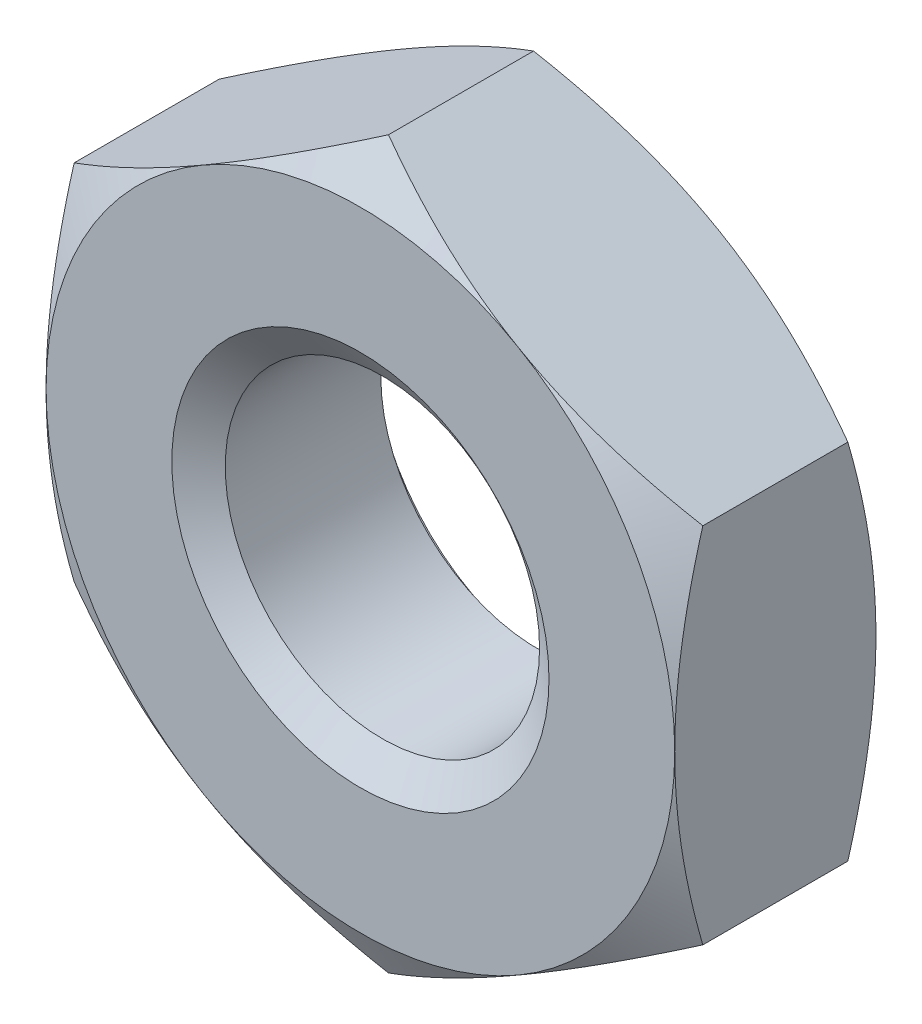
ISO-10303-21;
HEADER;
FILE_DESCRIPTION(('STEP AP214'),'2;1');
FILE_NAME('part.step','',(''),(''),'','','');
FILE_SCHEMA(('AUTOMOTIVE_DESIGN { 1 0 10303 214 1 1 1 1 }'));
ENDSEC;
DATA;
#1=APPLICATION_CONTEXT('core data for automotive mechanical design processes');
#2=APPLICATION_PROTOCOL_DEFINITION('international standard','automotive_design',2000,#1);
#3=PRODUCT_CONTEXT('',#1,'mechanical');
#4=PRODUCT('Part','Part','',(#3));
#5=PRODUCT_RELATED_PRODUCT_CATEGORY('part','',(#4));
#6=PRODUCT_DEFINITION_FORMATION('','',#4);
#7=PRODUCT_DEFINITION_CONTEXT('part definition',#1,'design');
#8=PRODUCT_DEFINITION('design','',#6,#7);
#9=PRODUCT_DEFINITION_SHAPE('','',#8);
#10=(LENGTH_UNIT() NAMED_UNIT(*) SI_UNIT(.MILLI.,.METRE.));
#11=(NAMED_UNIT(*) PLANE_ANGLE_UNIT() SI_UNIT($,.RADIAN.));
#12=(NAMED_UNIT(*) SI_UNIT($,.STERADIAN.) SOLID_ANGLE_UNIT());
#13=UNCERTAINTY_MEASURE_WITH_UNIT(LENGTH_MEASURE(1.E-05),#10,'distance_accuracy_value','');
#14=(GEOMETRIC_REPRESENTATION_CONTEXT(3) GLOBAL_UNCERTAINTY_ASSIGNED_CONTEXT((#13)) GLOBAL_UNIT_ASSIGNED_CONTEXT((#10,
#11,#12)) REPRESENTATION_CONTEXT('',''));
#15=CARTESIAN_POINT('',(0.,0.,0.));
#16=DIRECTION('',(0.,0.,1.));
#17=DIRECTION('',(1.,0.,0.));
#18=AXIS2_PLACEMENT_3D('',#15,#16,#17);
#19=CARTESIAN_POINT('',(0.,0.,-3.2));
#20=DIRECTION('',(0.,0.,1.));
#21=DIRECTION('',(1.,0.,0.));
#22=AXIS2_PLACEMENT_3D('',#19,#20,#21);
#23=CYLINDRICAL_SURFACE('',#22,2.5);
#24=CARTESIAN_POINT('',(0.,0.,-0.350103769104854));
#25=DIRECTION('',(0.,0.,1.));
#26=DIRECTION('',(1.,0.,0.));
#27=AXIS2_PLACEMENT_3D('',#24,#25,#26);
#28=CIRCLE('',#27,2.5);
#29=CARTESIAN_POINT('',(2.5,0.,-0.350103769104854));
#30=VERTEX_POINT('',#29);
#31=EDGE_CURVE('E176',#30,#30,#28,.F.);
#32=ORIENTED_EDGE('',*,*,#31,.F.);
#33=EDGE_LOOP('',(#32));
#34=FACE_BOUND('',#33,.T.);
#35=CARTESIAN_POINT('',(0.,0.,-2.82449623089514));
#36=DIRECTION('',(0.,0.,-1.));
#37=DIRECTION('',(-1.,0.,0.));
#38=AXIS2_PLACEMENT_3D('',#35,#36,#37);
#39=CIRCLE('',#38,2.5);
#40=CARTESIAN_POINT('',(-2.5,0.,-2.82449623089514));
#41=VERTEX_POINT('',#40);
#42=EDGE_CURVE('E40',#41,#41,#39,.F.);
#43=ORIENTED_EDGE('',*,*,#42,.F.);
#44=EDGE_LOOP('',(#43));
#45=FACE_BOUND('',#44,.T.);
#46=ADVANCED_FACE('F35',(#34,#45),#23,.F.);
#47=CARTESIAN_POINT('',(0.,5.77350269189626,-3.2));
#48=DIRECTION('',(-0.5,0.866025403784439,0.));
#49=DIRECTION('',(-0.866025403784439,-0.500000000000001,0.));
#50=AXIS2_PLACEMENT_3D('',#47,#48,#49);
#51=PLANE('',#50);
#52=DIRECTION('',(0.,0.,1.));
#53=VECTOR('',#52,1.);
#54=CARTESIAN_POINT('',(-5.,2.88675134594813,-3.2));
#55=LINE('',#54,#53);
#56=CARTESIAN_POINT('',(-5.,2.88675134594813,-2.7534180126148));
#57=VERTEX_POINT('',#56);
#58=CARTESIAN_POINT('',(-5.,2.88675134594813,-0.446581987385206));
#59=VERTEX_POINT('',#58);
#60=EDGE_CURVE('E166',#57,#59,#55,.T.);
#61=ORIENTED_EDGE('',*,*,#60,.T.);
#62=CARTESIAN_POINT('',(-5.0002,2.88663587589429,-0.446648656051832));
#63=CARTESIAN_POINT('',(-4.78046540547482,3.01349970319368,-0.373386567637638));
#64=CARTESIAN_POINT('',(-4.55885141554042,3.14144859993849,-0.306751321918095));
#65=CARTESIAN_POINT('',(-4.11178600454649,3.39956193532121,-0.190438991010813));
#66=CARTESIAN_POINT('',(-3.88632664040923,3.52973095989718,-0.14080304991579));
#67=CARTESIAN_POINT('',(-3.43816769477649,3.78847564779798,-0.0635510254186988));
#68=CARTESIAN_POINT('',(-3.21553790689581,3.91701101576052,-0.0354203782834903));
#69=CARTESIAN_POINT('',(-2.88081009815336,4.11026620624323,-0.0101949219536854));
#70=CARTESIAN_POINT('',(-2.76915780319494,4.17472868879311,-0.00461345976948479));
#71=CARTESIAN_POINT('',(-2.5457500293262,4.30371322717528,0.000797783248529184));
#72=CARTESIAN_POINT('',(-2.43399455370968,4.36823528110589,0.000627741741796185));
#73=CARTESIAN_POINT('',(-2.12781576914936,4.54500768479194,-0.00775363179203716));
#74=CARTESIAN_POINT('',(-1.93349391403278,4.65719946015293,-0.021829771897253));
#75=CARTESIAN_POINT('',(-1.54613989800229,4.88083840557982,-0.0664652571094332));
#76=CARTESIAN_POINT('',(-1.35310909862843,4.99228478956021,-0.0970398601475105));
#77=CARTESIAN_POINT('',(-0.964974657525144,5.21637431361295,-0.173468493621167));
#78=CARTESIAN_POINT('',(-0.769920001358263,5.32898917185759,-0.219646378878684));
#79=CARTESIAN_POINT('',(-0.382719654641231,5.55253939626498,-0.324451794491939));
#80=CARTESIAN_POINT('',(-0.190569004591913,5.66347762579592,-0.383054703437378));
#81=CARTESIAN_POINT('',(0.000200000000001414,5.7736181619501,-0.446648656051832));
#82=B_SPLINE_CURVE_WITH_KNOTS('',3,(#62,#63,#64,#65,#66,#67,#68,#69,#70,#71,#72,#73,#74,#75,#76,
#77,#78,#79,#80,#81),.UNSPECIFIED.,.F.,.F.,(4,2,2,2,2,2,2,2,2,4),(0.,0.792555841363091,
1.58701660053334,2.36181537487281,2.74884076077326,3.13585419177295,3.8096236259968,
4.48401723901189,5.17336882348929,5.86136694793725),.UNSPECIFIED.);
#83=CARTESIAN_POINT('',(-2.5,4.33012701892219,0.));
#84=VERTEX_POINT('',#83);
#85=EDGE_CURVE('E62',#59,#84,#82,.T.);
#86=ORIENTED_EDGE('',*,*,#85,.T.);
#87=CARTESIAN_POINT('',(0.,5.77350269189626,-0.446581987385206));
#88=VERTEX_POINT('',#87);
#89=EDGE_CURVE('E240',#84,#88,#82,.T.);
#90=ORIENTED_EDGE('',*,*,#89,.T.);
#91=DIRECTION('',(0.,0.,1.));
#92=VECTOR('',#91,1.);
#93=CARTESIAN_POINT('',(0.,5.77350269189626,-3.2));
#94=LINE('',#93,#92);
#95=CARTESIAN_POINT('',(0.,5.77350269189626,-2.7534180126148));
#96=VERTEX_POINT('',#95);
#97=EDGE_CURVE('E151',#96,#88,#94,.T.);
#98=ORIENTED_EDGE('',*,*,#97,.F.);
#99=CARTESIAN_POINT('',(-5.0002,2.88663587589429,-2.75335134394817));
#100=CARTESIAN_POINT('',(-4.78046540547482,3.01349970319368,-2.82661343236236));
#101=CARTESIAN_POINT('',(-4.55885141554042,3.14144859993849,-2.89324867808191));
#102=CARTESIAN_POINT('',(-4.11178600454649,3.39956193532121,-3.00956100898919));
#103=CARTESIAN_POINT('',(-3.88632664040923,3.52973095989718,-3.05919695008421));
#104=CARTESIAN_POINT('',(-3.43816769477649,3.78847564779798,-3.1364489745813));
#105=CARTESIAN_POINT('',(-3.21553790689581,3.91701101576052,-3.16457962171651));
#106=CARTESIAN_POINT('',(-2.88081009815336,4.11026620624323,-3.18980507804632));
#107=CARTESIAN_POINT('',(-2.76915780319494,4.17472868879311,-3.19538654023052));
#108=CARTESIAN_POINT('',(-2.5457500293262,4.30371322717528,-3.20079778324853));
#109=CARTESIAN_POINT('',(-2.43399455370968,4.36823528110589,-3.2006277417418));
#110=CARTESIAN_POINT('',(-2.12781576914936,4.54500768479194,-3.19224636820796));
#111=CARTESIAN_POINT('',(-1.93349391403278,4.65719946015293,-3.17817022810275));
#112=CARTESIAN_POINT('',(-1.54613989800229,4.88083840557982,-3.13353474289057));
#113=CARTESIAN_POINT('',(-1.35310909862843,4.99228478956021,-3.10296013985249));
#114=CARTESIAN_POINT('',(-0.964974657525144,5.21637431361295,-3.02653150637883));
#115=CARTESIAN_POINT('',(-0.769920001358262,5.32898917185759,-2.98035362112132));
#116=CARTESIAN_POINT('',(-0.38271965464123,5.55253939626498,-2.87554820550806));
#117=CARTESIAN_POINT('',(-0.190569004591912,5.66347762579592,-2.81694529656262));
#118=CARTESIAN_POINT('',(0.000200000000001414,5.7736181619501,-2.75335134394817));
#119=B_SPLINE_CURVE_WITH_KNOTS('',3,(#99,#100,#101,#102,#103,#104,#105,#106,#107,#108,#109,#110,
#111,#112,#113,#114,#115,#116,#117,#118),.UNSPECIFIED.,.F.,.F.,(4,2,2,2,2,2,2,2,2,4),(0.,
0.792555841363092,1.58701660053334,2.36181537487281,2.74884076077326,3.13585419177295,
3.8096236259968,4.4840172390119,5.17336882348929,5.86136694793726),.UNSPECIFIED.);
#120=CARTESIAN_POINT('',(-2.5,4.33012701892219,-3.2));
#121=VERTEX_POINT('',#120);
#122=EDGE_CURVE('E169',#121,#96,#119,.T.);
#123=ORIENTED_EDGE('',*,*,#122,.F.);
#124=EDGE_CURVE('E261',#57,#121,#119,.T.);
#125=ORIENTED_EDGE('',*,*,#124,.F.);
#126=EDGE_LOOP('',(#61,#86,#90,#98,#123,#125));
#127=FACE_BOUND('',#126,.T.);
#128=ADVANCED_FACE('F37',(#127),#51,.T.);
#129=CARTESIAN_POINT('',(5.,2.88675134594813,-3.2));
#130=DIRECTION('',(0.500000000000001,0.866025403784439,0.));
#131=DIRECTION('',(-0.866025403784439,0.500000000000001,0.));
#132=AXIS2_PLACEMENT_3D('',#129,#130,#131);
#133=PLANE('',#132);
#134=ORIENTED_EDGE('',*,*,#97,.T.);
#135=CARTESIAN_POINT('',(-0.000199999999997945,5.7736181619501,-0.446648656051832));
#136=CARTESIAN_POINT('',(0.219534594525187,5.64675433465071,-0.373386567637638));
#137=CARTESIAN_POINT('',(0.441148584459583,5.5188054379059,-0.306751321918095));
#138=CARTESIAN_POINT('',(0.888213995453516,5.26069210252318,-0.190438991010813));
#139=CARTESIAN_POINT('',(1.11367335959078,5.13052307794721,-0.14080304991579));
#140=CARTESIAN_POINT('',(1.56183230522351,4.87177839004641,-0.0635510254186984));
#141=CARTESIAN_POINT('',(1.7844620931042,4.74324302208387,-0.0354203782834898));
#142=CARTESIAN_POINT('',(2.11918990184665,4.54998783160116,-0.0101949219536851));
#143=CARTESIAN_POINT('',(2.23084219680507,4.48552534905128,-0.00461345976948458));
#144=CARTESIAN_POINT('',(2.4542499706738,4.35654081066911,0.000797783248529218));
#145=CARTESIAN_POINT('',(2.56600544629032,4.2920187567385,0.000627741741796173));
#146=CARTESIAN_POINT('',(2.87218423085064,4.11524635305244,-0.00775363179203714));
#147=CARTESIAN_POINT('',(3.06650608596722,4.00305457769146,-0.0218297718972527));
#148=CARTESIAN_POINT('',(3.45386010199771,3.77941563226457,-0.0664652571094328));
#149=CARTESIAN_POINT('',(3.64689090137157,3.66796924828418,-0.0970398601475101));
#150=CARTESIAN_POINT('',(4.03502534247486,3.44387972423144,-0.173468493621166));
#151=CARTESIAN_POINT('',(4.23007999864174,3.3312648659868,-0.219646378878683));
#152=CARTESIAN_POINT('',(4.61728034535877,3.1077146415794,-0.324451794491937));
#153=CARTESIAN_POINT('',(4.80943099540809,2.99677641204847,-0.383054703437377));
#154=CARTESIAN_POINT('',(5.0002,2.88663587589429,-0.446648656051832));
#155=B_SPLINE_CURVE_WITH_KNOTS('',3,(#135,#136,#137,#138,#139,#140,#141,#142,#143,#144,#145,
#146,#147,#148,#149,#150,#151,#152,#153,#154),.UNSPECIFIED.,.F.,.F.,(4,2,2,2,2,2,2,2,2,4),(0.,
0.792555841363091,1.58701660053334,2.36181537487281,2.74884076077326,3.13585419177295,
3.8096236259968,4.4840172390119,5.17336882348929,5.86136694793725),.UNSPECIFIED.);
#156=CARTESIAN_POINT('',(2.5,4.33012701892219,0.));
#157=VERTEX_POINT('',#156);
#158=EDGE_CURVE('E144',#88,#157,#155,.T.);
#159=ORIENTED_EDGE('',*,*,#158,.T.);
#160=CARTESIAN_POINT('',(5.,2.88675134594813,-0.446581987385206));
#161=VERTEX_POINT('',#160);
#162=EDGE_CURVE('E130',#157,#161,#155,.T.);
#163=ORIENTED_EDGE('',*,*,#162,.T.);
#164=DIRECTION('',(0.,0.,1.));
#165=VECTOR('',#164,1.);
#166=CARTESIAN_POINT('',(5.,2.88675134594813,-3.2));
#167=LINE('',#166,#165);
#168=CARTESIAN_POINT('',(5.,2.88675134594813,-2.7534180126148));
#169=VERTEX_POINT('',#168);
#170=EDGE_CURVE('E143',#169,#161,#167,.T.);
#171=ORIENTED_EDGE('',*,*,#170,.F.);
#172=CARTESIAN_POINT('',(-0.000199999999997945,5.7736181619501,-2.75335134394817));
#173=CARTESIAN_POINT('',(0.219534594525188,5.64675433465071,-2.82661343236236));
#174=CARTESIAN_POINT('',(0.441148584459583,5.5188054379059,-2.89324867808191));
#175=CARTESIAN_POINT('',(0.888213995453516,5.26069210252318,-3.00956100898919));
#176=CARTESIAN_POINT('',(1.11367335959078,5.13052307794721,-3.05919695008421));
#177=CARTESIAN_POINT('',(1.56183230522351,4.87177839004641,-3.1364489745813));
#178=CARTESIAN_POINT('',(1.7844620931042,4.74324302208387,-3.16457962171651));
#179=CARTESIAN_POINT('',(2.11918990184665,4.54998783160116,-3.18980507804632));
#180=CARTESIAN_POINT('',(2.23084219680507,4.48552534905128,-3.19538654023052));
#181=CARTESIAN_POINT('',(2.4542499706738,4.35654081066911,-3.20079778324853));
#182=CARTESIAN_POINT('',(2.56600544629032,4.2920187567385,-3.2006277417418));
#183=CARTESIAN_POINT('',(2.87218423085064,4.11524635305244,-3.19224636820796));
#184=CARTESIAN_POINT('',(3.06650608596722,4.00305457769146,-3.17817022810275));
#185=CARTESIAN_POINT('',(3.45386010199771,3.77941563226457,-3.13353474289057));
#186=CARTESIAN_POINT('',(3.64689090137157,3.66796924828418,-3.10296013985249));
#187=CARTESIAN_POINT('',(4.03502534247486,3.44387972423144,-3.02653150637884));
#188=CARTESIAN_POINT('',(4.23007999864174,3.3312648659868,-2.98035362112132));
#189=CARTESIAN_POINT('',(4.61728034535877,3.1077146415794,-2.87554820550806));
#190=CARTESIAN_POINT('',(4.80943099540809,2.99677641204847,-2.81694529656262));
#191=CARTESIAN_POINT('',(5.0002,2.88663587589429,-2.75335134394817));
#192=B_SPLINE_CURVE_WITH_KNOTS('',3,(#172,#173,#174,#175,#176,#177,#178,#179,#180,#181,#182,
#183,#184,#185,#186,#187,#188,#189,#190,#191),.UNSPECIFIED.,.F.,.F.,(4,2,2,2,2,2,2,2,2,4),(0.,
0.792555841363092,1.58701660053334,2.36181537487281,2.74884076077326,3.13585419177295,
3.8096236259968,4.48401723901189,5.17336882348929,5.86136694793725),.UNSPECIFIED.);
#193=CARTESIAN_POINT('',(2.5,4.33012701892219,-3.2));
#194=VERTEX_POINT('',#193);
#195=EDGE_CURVE('E255',#194,#169,#192,.T.);
#196=ORIENTED_EDGE('',*,*,#195,.F.);
#197=EDGE_CURVE('E260',#96,#194,#192,.T.);
#198=ORIENTED_EDGE('',*,*,#197,.F.);
#199=EDGE_LOOP('',(#134,#159,#163,#171,#196,#198));
#200=FACE_BOUND('',#199,.T.);
#201=ADVANCED_FACE('F141',(#200),#133,.T.);
#202=CARTESIAN_POINT('',(5.,2.88675134594813,-3.2));
#203=DIRECTION('',(-1.,0.,0.));
#204=DIRECTION('',(0.,0.,1.));
#205=AXIS2_PLACEMENT_3D('',#202,#203,#204);
#206=PLANE('',#205);
#207=CARTESIAN_POINT('',(5.,-7.65608998744865,-2.3926335265508));
#208=CARTESIAN_POINT('',(5.,-7.43656171400166,-2.28654533817208));
#209=CARTESIAN_POINT('',(5.,-7.21651440170022,-2.18151175461596));
#210=CARTESIAN_POINT('',(5.,-6.77510105921519,-1.97415643363977));
#211=CARTESIAN_POINT('',(5.,-6.55373480873053,-1.87183516574569));
#212=CARTESIAN_POINT('',(5.,-6.10820714710357,-1.66996807853491));
#213=CARTESIAN_POINT('',(5.,-5.88403698971125,-1.57044149281731));
#214=CARTESIAN_POINT('',(5.,-5.43385418074677,-1.37566323278682));
#215=CARTESIAN_POINT('',(5.,-5.20784162594278,-1.28041133564244));
#216=CARTESIAN_POINT('',(5.,-4.75080884782756,-1.09418830918942));
#217=CARTESIAN_POINT('',(5.,-4.51976121099505,-1.0032840909987));
#218=CARTESIAN_POINT('',(5.,-4.054940534221,-0.828595302971953));
#219=CARTESIAN_POINT('',(5.,-3.82116719434025,-0.744811525247655));
#220=CARTESIAN_POINT('',(5.,-3.35100416711889,-0.586614632364622));
#221=CARTESIAN_POINT('',(5.,-3.11462125088188,-0.512181595225274));
#222=CARTESIAN_POINT('',(5.,-2.63849247870024,-0.375104393872379));
#223=CARTESIAN_POINT('',(5.,-2.3987477121033,-0.312456501596951));
#224=CARTESIAN_POINT('',(5.,-1.91574303714497,-0.20198775399487));
#225=CARTESIAN_POINT('',(5.,-1.672482210841,-0.154170846558643));
#226=CARTESIAN_POINT('',(5.,-1.18299359688664,-0.076595555792404));
#227=CARTESIAN_POINT('',(5.,-0.93676580661328,-0.0468371884284106));
#228=CARTESIAN_POINT('',(5.,-0.567032279323846,-0.0176512015862978));
#229=CARTESIAN_POINT('',(5.,-0.444105297658538,-0.0104963190599483));
#230=CARTESIAN_POINT('',(5.,-0.198053005238564,-0.00139545226904214));
#231=CARTESIAN_POINT('',(5.,-0.0749276970802274,0.000550599639613229));
#232=CARTESIAN_POINT('',(5.,0.171257999892354,-0.00081847034566562));
#233=CARTESIAN_POINT('',(5.,0.294318397227089,-0.00413211431301356));
#234=CARTESIAN_POINT('',(5.,0.540192730788842,-0.0159365972827612));
#235=CARTESIAN_POINT('',(5.,0.663006654263486,-0.0244276975701651));
#236=CARTESIAN_POINT('',(5.,0.960681872881669,-0.0511063802753005));
#237=CARTESIAN_POINT('',(5.,1.1353143627994,-0.0718889676982876));
#238=CARTESIAN_POINT('',(5.,1.48321675799389,-0.122765655722697));
#239=CARTESIAN_POINT('',(5.,1.65648647841236,-0.152860997990036));
#240=CARTESIAN_POINT('',(5.,2.00155426058699,-0.221298792011553));
#241=CARTESIAN_POINT('',(5.,2.17335067370373,-0.259649477486406));
#242=CARTESIAN_POINT('',(5.,2.51518168221054,-0.343428305385013));
#243=CARTESIAN_POINT('',(5.,2.6852163841931,-0.388856016914003));
#244=CARTESIAN_POINT('',(5.,3.02770318928892,-0.486887782054294));
#245=CARTESIAN_POINT('',(5.,3.20011248435312,-0.539640363823943));
#246=CARTESIAN_POINT('',(5.,3.54310870430177,-0.650357787302628));
#247=CARTESIAN_POINT('',(5.,3.71369679659714,-0.708319033907072));
#248=CARTESIAN_POINT('',(5.,4.05236610267974,-0.828256540728476));
#249=CARTESIAN_POINT('',(5.,4.22045602230056,-0.890208365426367));
#250=CARTESIAN_POINT('',(5.,4.55533171687448,-1.01774823413812));
#251=CARTESIAN_POINT('',(5.,4.72211693321415,-1.08333774778777));
#252=CARTESIAN_POINT('',(5.,4.88829623733356,-1.15038625817724));
#253=B_SPLINE_CURVE_WITH_KNOTS('',3,(#207,#208,#209,#210,#211,#212,#213,#214,#215,#216,#217,
#218,#219,#220,#221,#222,#223,#224,#225,#226,#227,#228,#229,#230,#231,#232,#233,#234,#235,#236,
#237,#238,#239,#240,#241,#242,#243,#244,#245,#246,#247,#248,#249,#250,#251,#252),.UNSPECIFIED.,
.F.,.F.,(4,2,2,2,2,2,2,2,2,2,2,2,2,2,2,2,2,2,2,2,2,2,4),(0.,0.731464740665351,1.46305528824909,
2.19883243307486,2.93457117856033,3.67934251246858,4.42419659013361,5.16743580871989,
5.91043951739339,6.65364083834806,7.39684281638516,7.76615414335457,8.13546067426611,
8.50466345177856,8.87388486298453,9.40118542949727,9.92855633110015,10.4564556797854,
10.9843228991235,11.525120280828,12.065547221064,12.6029322754131,13.1405360390026),.UNSPECIFIED.);
#254=CARTESIAN_POINT('',(5.,-2.88675134594814,-0.446581987385206));
#255=VERTEX_POINT('',#254);
#256=CARTESIAN_POINT('',(5.,0.,0.));
#257=VERTEX_POINT('',#256);
#258=EDGE_CURVE('E136',#255,#257,#253,.T.);
#259=ORIENTED_EDGE('',*,*,#258,.F.);
#260=DIRECTION('',(0.,0.,1.));
#261=VECTOR('',#260,1.);
#262=CARTESIAN_POINT('',(5.,-2.88675134594814,-3.2));
#263=LINE('',#262,#261);
#264=CARTESIAN_POINT('',(5.,-2.88675134594814,-2.7534180126148));
#265=VERTEX_POINT('',#264);
#266=EDGE_CURVE('E152',#265,#255,#263,.T.);
#267=ORIENTED_EDGE('',*,*,#266,.F.);
#268=CARTESIAN_POINT('',(5.,-7.65608998744865,-0.8073664734492));
#269=CARTESIAN_POINT('',(5.,-7.43656171400166,-0.913454661827926));
#270=CARTESIAN_POINT('',(5.,-7.21651440170022,-1.01848824538404));
#271=CARTESIAN_POINT('',(5.,-6.77510105921519,-1.22584356636023));
#272=CARTESIAN_POINT('',(5.,-6.55373480873053,-1.32816483425431));
#273=CARTESIAN_POINT('',(5.,-6.10820714710357,-1.53003192146509));
#274=CARTESIAN_POINT('',(5.,-5.88403698971125,-1.62955850718269));
#275=CARTESIAN_POINT('',(5.,-5.43385418074677,-1.82433676721318));
#276=CARTESIAN_POINT('',(5.,-5.20784162594278,-1.91958866435757));
#277=CARTESIAN_POINT('',(5.,-4.75080884782756,-2.10581169081058));
#278=CARTESIAN_POINT('',(5.,-4.51976121099505,-2.1967159090013));
#279=CARTESIAN_POINT('',(5.,-4.054940534221,-2.37140469702805));
#280=CARTESIAN_POINT('',(5.,-3.82116719434025,-2.45518847475235));
#281=CARTESIAN_POINT('',(5.,-3.35100416711889,-2.61338536763538));
#282=CARTESIAN_POINT('',(5.,-3.11462125088188,-2.68781840477473));
#283=CARTESIAN_POINT('',(5.,-2.63849247870023,-2.82489560612762));
#284=CARTESIAN_POINT('',(5.,-2.3987477121033,-2.88754349840305));
#285=CARTESIAN_POINT('',(5.,-1.91574303714497,-2.99801224600513));
#286=CARTESIAN_POINT('',(5.,-1.672482210841,-3.04582915344136));
#287=CARTESIAN_POINT('',(5.,-1.18299359688664,-3.1234044442076));
#288=CARTESIAN_POINT('',(5.,-0.936765806613281,-3.15316281157159));
#289=CARTESIAN_POINT('',(5.,-0.567032279323847,-3.1823487984137));
#290=CARTESIAN_POINT('',(5.,-0.444105297658539,-3.18950368094005));
#291=CARTESIAN_POINT('',(5.,-0.198053005238564,-3.19860454773096));
#292=CARTESIAN_POINT('',(5.,-0.0749276970802276,-3.20055059963961));
#293=CARTESIAN_POINT('',(5.,0.171257999892354,-3.19918152965434));
#294=CARTESIAN_POINT('',(5.,0.29431839722709,-3.19586788568699));
#295=CARTESIAN_POINT('',(5.,0.540192730788842,-3.18406340271724));
#296=CARTESIAN_POINT('',(5.,0.663006654263484,-3.17557230242983));
#297=CARTESIAN_POINT('',(5.,0.960681872881667,-3.1488936197247));
#298=CARTESIAN_POINT('',(5.,1.1353143627994,-3.12811103230171));
#299=CARTESIAN_POINT('',(5.,1.48321675799389,-3.0772343442773));
#300=CARTESIAN_POINT('',(5.,1.65648647841236,-3.04713900200997));
#301=CARTESIAN_POINT('',(5.,2.00155426058699,-2.97870120798845));
#302=CARTESIAN_POINT('',(5.,2.17335067370373,-2.9403505225136));
#303=CARTESIAN_POINT('',(5.,2.51518168221054,-2.85657169461499));
#304=CARTESIAN_POINT('',(5.,2.6852163841931,-2.811143983086));
#305=CARTESIAN_POINT('',(5.,3.02770318928892,-2.71311221794571));
#306=CARTESIAN_POINT('',(5.,3.20011248435312,-2.66035963617606));
#307=CARTESIAN_POINT('',(5.,3.54310870430177,-2.54964221269737));
#308=CARTESIAN_POINT('',(5.,3.71369679659714,-2.49168096609293));
#309=CARTESIAN_POINT('',(5.,4.05236610267974,-2.37174345927153));
#310=CARTESIAN_POINT('',(5.,4.22045602230056,-2.30979163457363));
#311=CARTESIAN_POINT('',(5.,4.55533171687448,-2.18225176586188));
#312=CARTESIAN_POINT('',(5.,4.72211693321415,-2.11666225221223));
#313=CARTESIAN_POINT('',(5.,4.88829623733356,-2.04961374182275));
#314=B_SPLINE_CURVE_WITH_KNOTS('',3,(#268,#269,#270,#271,#272,#273,#274,#275,#276,#277,#278,
#279,#280,#281,#282,#283,#284,#285,#286,#287,#288,#289,#290,#291,#292,#293,#294,#295,#296,#297,
#298,#299,#300,#301,#302,#303,#304,#305,#306,#307,#308,#309,#310,#311,#312,#313),.UNSPECIFIED.,
.F.,.F.,(4,2,2,2,2,2,2,2,2,2,2,2,2,2,2,2,2,2,2,2,2,2,4),(0.,0.73146474066535,1.46305528824908,
2.19883243307486,2.93457117856033,3.67934251246858,4.42419659013361,5.16743580871989,
5.91043951739339,6.65364083834806,7.39684281638516,7.76615414335457,8.13546067426611,
8.50466345177856,8.87388486298453,9.40118542949727,9.92855633110015,10.4564556797854,
10.9843228991235,11.525120280828,12.065547221064,12.6029322754131,13.1405360390026),.UNSPECIFIED.);
#315=CARTESIAN_POINT('',(5.,0.,-3.2));
#316=VERTEX_POINT('',#315);
#317=EDGE_CURVE('E266',#265,#316,#314,.T.);
#318=ORIENTED_EDGE('',*,*,#317,.T.);
#319=EDGE_CURVE('E150',#316,#169,#314,.T.);
#320=ORIENTED_EDGE('',*,*,#319,.T.);
#321=ORIENTED_EDGE('',*,*,#170,.T.);
#322=EDGE_CURVE('E127',#257,#161,#253,.T.);
#323=ORIENTED_EDGE('',*,*,#322,.F.);
#324=EDGE_LOOP('',(#259,#267,#318,#320,#321,#323));
#325=FACE_BOUND('',#324,.T.);
#326=ADVANCED_FACE('F147',(#325),#206,.F.);
#327=CARTESIAN_POINT('',(0.,-5.77350269189627,-3.2));
#328=DIRECTION('',(0.5,-0.866025403784439,0.));
#329=DIRECTION('',(0.866025403784439,0.500000000000001,0.));
#330=AXIS2_PLACEMENT_3D('',#327,#328,#329);
#331=PLANE('',#330);
#332=ORIENTED_EDGE('',*,*,#266,.T.);
#333=CARTESIAN_POINT('',(5.0002,-2.8866358758943,-0.446648656051832));
#334=CARTESIAN_POINT('',(4.78046540547482,-3.01349970319369,-0.37338656763764));
#335=CARTESIAN_POINT('',(4.55885141554042,-3.1414485999385,-0.306751321918098));
#336=CARTESIAN_POINT('',(4.11178600454649,-3.39956193532122,-0.190438991010817));
#337=CARTESIAN_POINT('',(3.88632664040923,-3.52973095989719,-0.140803049915795));
#338=CARTESIAN_POINT('',(3.43816769477649,-3.78847564779799,-0.063551025418703));
#339=CARTESIAN_POINT('',(3.21553790689581,-3.91701101576053,-0.0354203782834938));
#340=CARTESIAN_POINT('',(2.88081009815336,-4.11026620624324,-0.0101949219536904));
#341=CARTESIAN_POINT('',(2.76915780319494,-4.17472868879312,-0.0046134597694907));
#342=CARTESIAN_POINT('',(2.5457500293262,-4.30371322717529,0.000797783248525337));
#343=CARTESIAN_POINT('',(2.43399455370968,-4.3682352811059,0.000627741741795326));
#344=CARTESIAN_POINT('',(2.12781576914936,-4.54500768479195,-0.00775363179203567));
#345=CARTESIAN_POINT('',(1.93349391403279,-4.65719946015294,-0.0218297718972565));
#346=CARTESIAN_POINT('',(1.5461398980023,-4.88083840557983,-0.0664652571094402));
#347=CARTESIAN_POINT('',(1.35310909862843,-4.99228478956021,-0.0970398601475162));
#348=CARTESIAN_POINT('',(0.964974657525146,-5.21637431361296,-0.173468493621172));
#349=CARTESIAN_POINT('',(0.769920001358265,-5.3289891718576,-0.219646378878689));
#350=CARTESIAN_POINT('',(0.382719654641233,-5.55253939626499,-0.324451794491944));
#351=CARTESIAN_POINT('',(0.190569004591915,-5.66347762579593,-0.383054703437384));
#352=CARTESIAN_POINT('',(-0.000200000000000547,-5.7736181619501,-0.446648656051835));
#353=B_SPLINE_CURVE_WITH_KNOTS('',3,(#333,#334,#335,#336,#337,#338,#339,#340,#341,#342,#343,
#344,#345,#346,#347,#348,#349,#350,#351,#352),.UNSPECIFIED.,.F.,.F.,(4,2,2,2,2,2,2,2,2,4),(0.,
0.792555841363092,1.58701660053334,2.36181537487281,2.74884076077326,3.13585419177295,
3.8096236259968,4.4840172390119,5.17336882348929,5.86136694793726),.UNSPECIFIED.);
#354=CARTESIAN_POINT('',(2.5,-4.3301270189222,0.));
#355=VERTEX_POINT('',#354);
#356=EDGE_CURVE('E458',#255,#355,#353,.T.);
#357=ORIENTED_EDGE('',*,*,#356,.T.);
#358=CARTESIAN_POINT('',(0.,-5.77350269189627,-0.446581987385206));
#359=VERTEX_POINT('',#358);
#360=EDGE_CURVE('E227',#355,#359,#353,.T.);
#361=ORIENTED_EDGE('',*,*,#360,.T.);
#362=DIRECTION('',(0.,0.,1.));
#363=VECTOR('',#362,1.);
#364=CARTESIAN_POINT('',(0.,-5.77350269189627,-3.2));
#365=LINE('',#364,#363);
#366=CARTESIAN_POINT('',(0.,-5.77350269189627,-2.7534180126148));
#367=VERTEX_POINT('',#366);
#368=EDGE_CURVE('E157',#367,#359,#365,.T.);
#369=ORIENTED_EDGE('',*,*,#368,.F.);
#370=CARTESIAN_POINT('',(5.0002,-2.8866358758943,-2.75335134394817));
#371=CARTESIAN_POINT('',(4.78046540547482,-3.01349970319369,-2.82661343236236));
#372=CARTESIAN_POINT('',(4.55885141554042,-3.1414485999385,-2.8932486780819));
#373=CARTESIAN_POINT('',(4.11178600454649,-3.39956193532122,-3.00956100898918));
#374=CARTESIAN_POINT('',(3.88632664040923,-3.52973095989719,-3.05919695008421));
#375=CARTESIAN_POINT('',(3.43816769477649,-3.78847564779799,-3.1364489745813));
#376=CARTESIAN_POINT('',(3.21553790689581,-3.91701101576053,-3.16457962171651));
#377=CARTESIAN_POINT('',(2.88081009815336,-4.11026620624324,-3.18980507804631));
#378=CARTESIAN_POINT('',(2.76915780319494,-4.17472868879312,-3.19538654023051));
#379=CARTESIAN_POINT('',(2.5457500293262,-4.30371322717529,-3.20079778324853));
#380=CARTESIAN_POINT('',(2.43399455370968,-4.3682352811059,-3.20062774174179));
#381=CARTESIAN_POINT('',(2.12781576914936,-4.54500768479195,-3.19224636820796));
#382=CARTESIAN_POINT('',(1.93349391403279,-4.65719946015294,-3.17817022810274));
#383=CARTESIAN_POINT('',(1.5461398980023,-4.88083840557983,-3.13353474289056));
#384=CARTESIAN_POINT('',(1.35310909862843,-4.99228478956021,-3.10296013985249));
#385=CARTESIAN_POINT('',(0.964974657525146,-5.21637431361296,-3.02653150637883));
#386=CARTESIAN_POINT('',(0.769920001358265,-5.3289891718576,-2.98035362112131));
#387=CARTESIAN_POINT('',(0.382719654641233,-5.55253939626499,-2.87554820550806));
#388=CARTESIAN_POINT('',(0.190569004591914,-5.66347762579593,-2.81694529656262));
#389=CARTESIAN_POINT('',(-0.000200000000000547,-5.7736181619501,-2.75335134394817));
#390=B_SPLINE_CURVE_WITH_KNOTS('',3,(#370,#371,#372,#373,#374,#375,#376,#377,#378,#379,#380,
#381,#382,#383,#384,#385,#386,#387,#388,#389),.UNSPECIFIED.,.F.,.F.,(4,2,2,2,2,2,2,2,2,4),(0.,
0.792555841363093,1.58701660053334,2.36181537487281,2.74884076077326,3.13585419177295,
3.8096236259968,4.4840172390119,5.17336882348929,5.86136694793726),.UNSPECIFIED.);
#391=CARTESIAN_POINT('',(2.5,-4.3301270189222,-3.2));
#392=VERTEX_POINT('',#391);
#393=EDGE_CURVE('E272',#392,#367,#390,.T.);
#394=ORIENTED_EDGE('',*,*,#393,.F.);
#395=EDGE_CURVE('E271',#265,#392,#390,.T.);
#396=ORIENTED_EDGE('',*,*,#395,.F.);
#397=EDGE_LOOP('',(#332,#357,#361,#369,#394,#396));
#398=FACE_BOUND('',#397,.T.);
#399=ADVANCED_FACE('F282',(#398),#331,.T.);
#400=CARTESIAN_POINT('',(-5.,-2.88675134594813,-3.2));
#401=DIRECTION('',(-0.500000000000001,-0.866025403784439,0.));
#402=DIRECTION('',(0.866025403784439,-0.500000000000001,0.));
#403=AXIS2_PLACEMENT_3D('',#400,#401,#402);
#404=PLANE('',#403);
#405=ORIENTED_EDGE('',*,*,#368,.T.);
#406=CARTESIAN_POINT('',(0.000200000000000547,-5.7736181619501,-0.446648656051835));
#407=CARTESIAN_POINT('',(-0.219534594525186,-5.64675433465071,-0.373386567637642));
#408=CARTESIAN_POINT('',(-0.441148584459582,-5.5188054379059,-0.306751321918099));
#409=CARTESIAN_POINT('',(-0.888213995453517,-5.26069210252319,-0.190438991010817));
#410=CARTESIAN_POINT('',(-1.11367335959078,-5.13052307794722,-0.140803049915795));
#411=CARTESIAN_POINT('',(-1.56183230522351,-4.87177839004642,-0.0635510254187024));
#412=CARTESIAN_POINT('',(-1.7844620931042,-4.74324302208387,-0.0354203782834931));
#413=CARTESIAN_POINT('',(-2.11918990184665,-4.54998783160117,-0.010194921953689));
#414=CARTESIAN_POINT('',(-2.23084219680507,-4.48552534905128,-0.00461345976948903));
#415=CARTESIAN_POINT('',(-2.4542499706738,-4.35654081066911,0.000797783248526398));
#416=CARTESIAN_POINT('',(-2.56600544629032,-4.2920187567385,0.000627741741795484));
#417=CARTESIAN_POINT('',(-2.87218423085064,-4.11524635305245,-0.00775363179203595));
#418=CARTESIAN_POINT('',(-3.06650608596722,-4.00305457769147,-0.0218297718972548));
#419=CARTESIAN_POINT('',(-3.45386010199771,-3.77941563226458,-0.0664652571094368));
#420=CARTESIAN_POINT('',(-3.64689090137157,-3.66796924828419,-0.0970398601475131));
#421=CARTESIAN_POINT('',(-4.03502534247486,-3.44387972423144,-0.173468493621168));
#422=CARTESIAN_POINT('',(-4.23007999864174,-3.33126486598681,-0.219646378878685));
#423=CARTESIAN_POINT('',(-4.61728034535877,-3.10771464157941,-0.32445179449194));
#424=CARTESIAN_POINT('',(-4.80943099540809,-2.99677641204848,-0.38305470343738));
#425=CARTESIAN_POINT('',(-5.0002,-2.8866358758943,-0.446648656051832));
#426=B_SPLINE_CURVE_WITH_KNOTS('',3,(#406,#407,#408,#409,#410,#411,#412,#413,#414,#415,#416,
#417,#418,#419,#420,#421,#422,#423,#424,#425),.UNSPECIFIED.,.F.,.F.,(4,2,2,2,2,2,2,2,2,4),(0.,
0.792555841363093,1.58701660053334,2.36181537487281,2.74884076077326,3.13585419177296,
3.8096236259968,4.4840172390119,5.17336882348929,5.86136694793726),.UNSPECIFIED.);
#427=CARTESIAN_POINT('',(-2.5,-4.3301270189222,0.));
#428=VERTEX_POINT('',#427);
#429=EDGE_CURVE('E456',#359,#428,#426,.T.);
#430=ORIENTED_EDGE('',*,*,#429,.T.);
#431=CARTESIAN_POINT('',(-5.,-2.88675134594814,-0.446581987385206));
#432=VERTEX_POINT('',#431);
#433=EDGE_CURVE('E200',#428,#432,#426,.T.);
#434=ORIENTED_EDGE('',*,*,#433,.T.);
#435=DIRECTION('',(0.,0.,1.));
#436=VECTOR('',#435,1.);
#437=CARTESIAN_POINT('',(-5.,-2.88675134594813,-3.2));
#438=LINE('',#437,#436);
#439=CARTESIAN_POINT('',(-5.,-2.88675134594814,-2.7534180126148));
#440=VERTEX_POINT('',#439);
#441=EDGE_CURVE('E163',#440,#432,#438,.T.);
#442=ORIENTED_EDGE('',*,*,#441,.F.);
#443=CARTESIAN_POINT('',(0.000200000000000547,-5.7736181619501,-2.75335134394817));
#444=CARTESIAN_POINT('',(-0.219534594525186,-5.64675433465071,-2.82661343236236));
#445=CARTESIAN_POINT('',(-0.441148584459582,-5.5188054379059,-2.8932486780819));
#446=CARTESIAN_POINT('',(-0.888213995453516,-5.26069210252319,-3.00956100898918));
#447=CARTESIAN_POINT('',(-1.11367335959078,-5.13052307794722,-3.05919695008421));
#448=CARTESIAN_POINT('',(-1.56183230522351,-4.87177839004642,-3.1364489745813));
#449=CARTESIAN_POINT('',(-1.7844620931042,-4.74324302208387,-3.16457962171651));
#450=CARTESIAN_POINT('',(-2.11918990184665,-4.54998783160117,-3.18980507804631));
#451=CARTESIAN_POINT('',(-2.23084219680507,-4.48552534905129,-3.19538654023051));
#452=CARTESIAN_POINT('',(-2.4542499706738,-4.35654081066911,-3.20079778324853));
#453=CARTESIAN_POINT('',(-2.56600544629032,-4.2920187567385,-3.20062774174179));
#454=CARTESIAN_POINT('',(-2.87218423085064,-4.11524635305245,-3.19224636820796));
#455=CARTESIAN_POINT('',(-3.06650608596722,-4.00305457769147,-3.17817022810275));
#456=CARTESIAN_POINT('',(-3.45386010199771,-3.77941563226458,-3.13353474289057));
#457=CARTESIAN_POINT('',(-3.64689090137157,-3.66796924828419,-3.10296013985249));
#458=CARTESIAN_POINT('',(-4.03502534247486,-3.44387972423144,-3.02653150637883));
#459=CARTESIAN_POINT('',(-4.23007999864174,-3.3312648659868,-2.98035362112132));
#460=CARTESIAN_POINT('',(-4.61728034535877,-3.10771464157941,-2.87554820550806));
#461=CARTESIAN_POINT('',(-4.80943099540809,-2.99677641204847,-2.81694529656262));
#462=CARTESIAN_POINT('',(-5.0002,-2.8866358758943,-2.75335134394817));
#463=B_SPLINE_CURVE_WITH_KNOTS('',3,(#443,#444,#445,#446,#447,#448,#449,#450,#451,#452,#453,
#454,#455,#456,#457,#458,#459,#460,#461,#462),.UNSPECIFIED.,.F.,.F.,(4,2,2,2,2,2,2,2,2,4),(0.,
0.792555841363093,1.58701660053334,2.36181537487281,2.74884076077326,3.13585419177296,
3.8096236259968,4.4840172390119,5.17336882348929,5.86136694793726),.UNSPECIFIED.);
#464=CARTESIAN_POINT('',(-2.5,-4.3301270189222,-3.2));
#465=VERTEX_POINT('',#464);
#466=EDGE_CURVE('E278',#465,#440,#463,.T.);
#467=ORIENTED_EDGE('',*,*,#466,.F.);
#468=EDGE_CURVE('E277',#367,#465,#463,.T.);
#469=ORIENTED_EDGE('',*,*,#468,.F.);
#470=EDGE_LOOP('',(#405,#430,#434,#442,#467,#469));
#471=FACE_BOUND('',#470,.T.);
#472=ADVANCED_FACE('F285',(#471),#404,.T.);
#473=CARTESIAN_POINT('',(-5.,2.88675134594813,-3.2));
#474=DIRECTION('',(-1.,0.,0.));
#475=DIRECTION('',(0.,0.,1.));
#476=AXIS2_PLACEMENT_3D('',#473,#474,#475);
#477=PLANE('',#476);
#478=ORIENTED_EDGE('',*,*,#441,.T.);
#479=CARTESIAN_POINT('',(-5.,-7.65608998744865,-2.3926335265508));
#480=CARTESIAN_POINT('',(-5.,-7.43656171400166,-2.28654533817207));
#481=CARTESIAN_POINT('',(-5.,-7.21651440170021,-2.18151175461596));
#482=CARTESIAN_POINT('',(-5.,-6.77510105921518,-1.97415643363976));
#483=CARTESIAN_POINT('',(-5.,-6.55373480873052,-1.87183516574569));
#484=CARTESIAN_POINT('',(-5.,-6.10820714710357,-1.66996807853491));
#485=CARTESIAN_POINT('',(-5.,-5.88403698971124,-1.57044149281731));
#486=CARTESIAN_POINT('',(-5.,-5.43385418074677,-1.37566323278682));
#487=CARTESIAN_POINT('',(-5.,-5.20784162594278,-1.28041133564243));
#488=CARTESIAN_POINT('',(-5.,-4.75080884782755,-1.09418830918941));
#489=CARTESIAN_POINT('',(-5.,-4.51976121099505,-1.0032840909987));
#490=CARTESIAN_POINT('',(-5.,-4.05494053422099,-0.828595302971951));
#491=CARTESIAN_POINT('',(-5.,-3.82116719434024,-0.744811525247653));
#492=CARTESIAN_POINT('',(-5.,-3.35100416711889,-0.586614632364621));
#493=CARTESIAN_POINT('',(-5.,-3.11462125088187,-0.512181595225273));
#494=CARTESIAN_POINT('',(-5.,-2.63849247870023,-0.375104393872379));
#495=CARTESIAN_POINT('',(-5.,-2.3987477121033,-0.312456501596951));
#496=CARTESIAN_POINT('',(-5.,-1.91574303714497,-0.20198775399487));
#497=CARTESIAN_POINT('',(-5.,-1.67248221084099,-0.154170846558643));
#498=CARTESIAN_POINT('',(-5.,-1.18299359688664,-0.076595555792404));
#499=CARTESIAN_POINT('',(-5.,-0.936765806613278,-0.046837188428411));
#500=CARTESIAN_POINT('',(-5.,-0.567032279323844,-0.0176512015862984));
#501=CARTESIAN_POINT('',(-5.,-0.444105297658536,-0.0104963190599489));
#502=CARTESIAN_POINT('',(-5.,-0.198053005238561,-0.00139545226904261));
#503=CARTESIAN_POINT('',(-5.,-0.074927697080224,0.000550599639612786));
#504=CARTESIAN_POINT('',(-5.,0.171257999892357,-0.000818470345666173));
#505=CARTESIAN_POINT('',(-5.,0.294318397227092,-0.00413211431301421));
#506=CARTESIAN_POINT('',(-5.,0.540192730788844,-0.0159365972827616));
#507=CARTESIAN_POINT('',(-5.,0.663006654263487,-0.0244276975701651));
#508=CARTESIAN_POINT('',(-5.,0.960681872881671,-0.0511063802753005));
#509=CARTESIAN_POINT('',(-5.,1.1353143627994,-0.0718889676982882));
#510=CARTESIAN_POINT('',(-5.,1.48321675799389,-0.122765655722699));
#511=CARTESIAN_POINT('',(-5.,1.65648647841237,-0.152860997990037));
#512=CARTESIAN_POINT('',(-5.,2.00155426058699,-0.221298792011554));
#513=CARTESIAN_POINT('',(-5.,2.17335067370373,-0.259649477486408));
#514=CARTESIAN_POINT('',(-5.,2.51518168221054,-0.343428305385015));
#515=CARTESIAN_POINT('',(-5.,2.68521638419311,-0.388856016914005));
#516=CARTESIAN_POINT('',(-5.,3.02770318928892,-0.486887782054296));
#517=CARTESIAN_POINT('',(-5.,3.20011248435312,-0.539640363823946));
#518=CARTESIAN_POINT('',(-5.,3.54310870430177,-0.65035778730263));
#519=CARTESIAN_POINT('',(-5.,3.71369679659715,-0.708319033907073));
#520=CARTESIAN_POINT('',(-5.,4.05236610267974,-0.828256540728478));
#521=CARTESIAN_POINT('',(-5.,4.22045602230056,-0.890208365426369));
#522=CARTESIAN_POINT('',(-5.,4.55533171687449,-1.01774823413812));
#523=CARTESIAN_POINT('',(-5.,4.72211693321415,-1.08333774778777));
#524=CARTESIAN_POINT('',(-5.,4.88829623733356,-1.15038625817724));
#525=B_SPLINE_CURVE_WITH_KNOTS('',3,(#479,#480,#481,#482,#483,#484,#485,#486,#487,#488,#489,
#490,#491,#492,#493,#494,#495,#496,#497,#498,#499,#500,#501,#502,#503,#504,#505,#506,#507,#508,
#509,#510,#511,#512,#513,#514,#515,#516,#517,#518,#519,#520,#521,#522,#523,#524),.UNSPECIFIED.,
.F.,.F.,(4,2,2,2,2,2,2,2,2,2,2,2,2,2,2,2,2,2,2,2,2,2,4),(0.,0.731464740665352,1.46305528824909,
2.19883243307486,2.93457117856034,3.67934251246858,4.42419659013362,5.1674358087199,
5.91043951739339,6.65364083834806,7.39684281638516,7.76615414335456,8.13546067426611,
8.50466345177856,8.87388486298453,9.40118542949727,9.92855633110015,10.4564556797854,
10.9843228991235,11.525120280828,12.065547221064,12.6029322754131,13.1405360390026),.UNSPECIFIED.);
#526=CARTESIAN_POINT('',(-5.,0.,0.));
#527=VERTEX_POINT('',#526);
#528=EDGE_CURVE('E199',#432,#527,#525,.T.);
#529=ORIENTED_EDGE('',*,*,#528,.T.);
#530=EDGE_CURVE('E193',#527,#59,#525,.T.);
#531=ORIENTED_EDGE('',*,*,#530,.T.);
#532=ORIENTED_EDGE('',*,*,#60,.F.);
#533=CARTESIAN_POINT('',(-5.,-7.65608998744865,-0.8073664734492));
#534=CARTESIAN_POINT('',(-5.,-7.43656171400166,-0.913454661827927));
#535=CARTESIAN_POINT('',(-5.,-7.21651440170021,-1.01848824538404));
#536=CARTESIAN_POINT('',(-5.,-6.77510105921518,-1.22584356636024));
#537=CARTESIAN_POINT('',(-5.,-6.55373480873052,-1.32816483425431));
#538=CARTESIAN_POINT('',(-5.,-6.10820714710357,-1.53003192146509));
#539=CARTESIAN_POINT('',(-5.,-5.88403698971124,-1.62955850718269));
#540=CARTESIAN_POINT('',(-5.,-5.43385418074677,-1.82433676721318));
#541=CARTESIAN_POINT('',(-5.,-5.20784162594278,-1.91958866435757));
#542=CARTESIAN_POINT('',(-5.,-4.75080884782756,-2.10581169081059));
#543=CARTESIAN_POINT('',(-5.,-4.51976121099505,-2.1967159090013));
#544=CARTESIAN_POINT('',(-5.,-4.05494053422099,-2.37140469702805));
#545=CARTESIAN_POINT('',(-5.,-3.82116719434024,-2.45518847475235));
#546=CARTESIAN_POINT('',(-5.,-3.35100416711889,-2.61338536763538));
#547=CARTESIAN_POINT('',(-5.,-3.11462125088187,-2.68781840477473));
#548=CARTESIAN_POINT('',(-5.,-2.63849247870023,-2.82489560612762));
#549=CARTESIAN_POINT('',(-5.,-2.3987477121033,-2.88754349840305));
#550=CARTESIAN_POINT('',(-5.,-1.91574303714497,-2.99801224600513));
#551=CARTESIAN_POINT('',(-5.,-1.67248221084099,-3.04582915344136));
#552=CARTESIAN_POINT('',(-5.,-1.18299359688664,-3.1234044442076));
#553=CARTESIAN_POINT('',(-5.,-0.936765806613277,-3.15316281157159));
#554=CARTESIAN_POINT('',(-5.,-0.567032279323843,-3.1823487984137));
#555=CARTESIAN_POINT('',(-5.,-0.444105297658535,-3.18950368094005));
#556=CARTESIAN_POINT('',(-5.,-0.198053005238561,-3.19860454773096));
#557=CARTESIAN_POINT('',(-5.,-0.0749276970802242,-3.20055059963961));
#558=CARTESIAN_POINT('',(-5.,0.171257999892357,-3.19918152965434));
#559=CARTESIAN_POINT('',(-5.,0.294318397227092,-3.19586788568699));
#560=CARTESIAN_POINT('',(-5.,0.540192730788844,-3.18406340271724));
#561=CARTESIAN_POINT('',(-5.,0.663006654263487,-3.17557230242983));
#562=CARTESIAN_POINT('',(-5.,0.960681872881671,-3.1488936197247));
#563=CARTESIAN_POINT('',(-5.,1.1353143627994,-3.12811103230171));
#564=CARTESIAN_POINT('',(-5.,1.48321675799389,-3.0772343442773));
#565=CARTESIAN_POINT('',(-5.,1.65648647841237,-3.04713900200996));
#566=CARTESIAN_POINT('',(-5.,2.00155426058699,-2.97870120798845));
#567=CARTESIAN_POINT('',(-5.,2.17335067370373,-2.94035052251359));
#568=CARTESIAN_POINT('',(-5.,2.51518168221054,-2.85657169461499));
#569=CARTESIAN_POINT('',(-5.,2.68521638419311,-2.811143983086));
#570=CARTESIAN_POINT('',(-5.,3.02770318928892,-2.71311221794571));
#571=CARTESIAN_POINT('',(-5.,3.20011248435312,-2.66035963617606));
#572=CARTESIAN_POINT('',(-5.,3.54310870430177,-2.54964221269737));
#573=CARTESIAN_POINT('',(-5.,3.71369679659715,-2.49168096609293));
#574=CARTESIAN_POINT('',(-5.,4.05236610267974,-2.37174345927152));
#575=CARTESIAN_POINT('',(-5.,4.22045602230056,-2.30979163457363));
#576=CARTESIAN_POINT('',(-5.,4.55533171687449,-2.18225176586188));
#577=CARTESIAN_POINT('',(-5.,4.72211693321415,-2.11666225221223));
#578=CARTESIAN_POINT('',(-5.,4.88829623733356,-2.04961374182275));
#579=B_SPLINE_CURVE_WITH_KNOTS('',3,(#533,#534,#535,#536,#537,#538,#539,#540,#541,#542,#543,
#544,#545,#546,#547,#548,#549,#550,#551,#552,#553,#554,#555,#556,#557,#558,#559,#560,#561,#562,
#563,#564,#565,#566,#567,#568,#569,#570,#571,#572,#573,#574,#575,#576,#577,#578),.UNSPECIFIED.,
.F.,.F.,(4,2,2,2,2,2,2,2,2,2,2,2,2,2,2,2,2,2,2,2,2,2,4),(0.,0.731464740665351,1.46305528824908,
2.19883243307486,2.93457117856034,3.67934251246858,4.42419659013361,5.16743580871989,
5.91043951739339,6.65364083834806,7.39684281638516,7.76615414335456,8.13546067426611,
8.50466345177856,8.87388486298453,9.40118542949727,9.92855633110015,10.4564556797854,
10.9843228991235,11.525120280828,12.065547221064,12.6029322754131,13.1405360390026),.UNSPECIFIED.);
#580=CARTESIAN_POINT('',(-5.,0.,-3.2));
#581=VERTEX_POINT('',#580);
#582=EDGE_CURVE('E324',#581,#57,#579,.T.);
#583=ORIENTED_EDGE('',*,*,#582,.F.);
#584=EDGE_CURVE('E339',#440,#581,#579,.T.);
#585=ORIENTED_EDGE('',*,*,#584,.F.);
#586=EDGE_LOOP('',(#478,#529,#531,#532,#583,#585));
#587=FACE_BOUND('',#586,.T.);
#588=ADVANCED_FACE('F206',(#587),#477,.T.);
#589=CARTESIAN_POINT('',(-10.,0.,0.));
#590=DIRECTION('',(0.,0.,1.));
#591=DIRECTION('',(1.,0.,0.));
#592=AXIS2_PLACEMENT_3D('',#589,#590,#591);
#593=PLANE('',#592);
#594=CARTESIAN_POINT('',(0.,0.,0.));
#595=DIRECTION('',(0.,0.,1.));
#596=DIRECTION('',(1.,0.,0.));
#597=AXIS2_PLACEMENT_3D('',#594,#595,#596);
#598=CIRCLE('',#597,3.);
#599=CARTESIAN_POINT('',(3.,0.,0.));
#600=VERTEX_POINT('',#599);
#601=EDGE_CURVE('E178',#600,#600,#598,.T.);
#602=ORIENTED_EDGE('',*,*,#601,.F.);
#603=EDGE_LOOP('',(#602));
#604=FACE_BOUND('',#603,.T.);
#605=CARTESIAN_POINT('',(0.,0.,0.));
#606=DIRECTION('',(0.,0.,1.));
#607=DIRECTION('',(1.,0.,0.));
#608=AXIS2_PLACEMENT_3D('',#605,#606,#607);
#609=CIRCLE('',#608,5.);
#610=EDGE_CURVE('E47',#355,#257,#609,.T.);
#611=ORIENTED_EDGE('',*,*,#610,.T.);
#612=CARTESIAN_POINT('',(0.,0.,0.));
#613=DIRECTION('',(0.,0.,1.));
#614=DIRECTION('',(1.,0.,0.));
#615=AXIS2_PLACEMENT_3D('',#612,#613,#614);
#616=CIRCLE('',#615,5.);
#617=EDGE_CURVE('E54',#257,#157,#616,.T.);
#618=ORIENTED_EDGE('',*,*,#617,.T.);
#619=EDGE_CURVE('E11',#157,#84,#609,.T.);
#620=ORIENTED_EDGE('',*,*,#619,.T.);
#621=EDGE_CURVE('E45',#84,#527,#609,.T.);
#622=ORIENTED_EDGE('',*,*,#621,.T.);
#623=EDGE_CURVE('E359',#527,#428,#609,.T.);
#624=ORIENTED_EDGE('',*,*,#623,.T.);
#625=EDGE_CURVE('E175',#428,#355,#609,.T.);
#626=ORIENTED_EDGE('',*,*,#625,.T.);
#627=EDGE_LOOP('',(#611,#618,#620,#622,#624,#626));
#628=FACE_BOUND('',#627,.T.);
#629=ADVANCED_FACE('F251',(#604,#628),#593,.T.);
#630=CARTESIAN_POINT('',(-10.,0.,-3.2));
#631=DIRECTION('',(0.,0.,1.));
#632=DIRECTION('',(1.,0.,0.));
#633=AXIS2_PLACEMENT_3D('',#630,#631,#632);
#634=PLANE('',#633);
#635=CARTESIAN_POINT('',(0.,0.,-3.2));
#636=DIRECTION('',(0.,0.,1.));
#637=DIRECTION('',(1.,0.,0.));
#638=AXIS2_PLACEMENT_3D('',#635,#636,#637);
#639=CIRCLE('',#638,3.);
#640=CARTESIAN_POINT('',(3.,0.,-3.2));
#641=VERTEX_POINT('',#640);
#642=EDGE_CURVE('E179',#641,#641,#639,.F.);
#643=ORIENTED_EDGE('',*,*,#642,.F.);
#644=EDGE_LOOP('',(#643));
#645=FACE_BOUND('',#644,.T.);
#646=CARTESIAN_POINT('',(0.,0.,-3.2));
#647=DIRECTION('',(0.,0.,1.));
#648=DIRECTION('',(1.,0.,0.));
#649=AXIS2_PLACEMENT_3D('',#646,#647,#648);
#650=CIRCLE('',#649,5.);
#651=EDGE_CURVE('E246',#316,#194,#650,.T.);
#652=ORIENTED_EDGE('',*,*,#651,.F.);
#653=CARTESIAN_POINT('',(0.,0.,-3.2));
#654=DIRECTION('',(0.,0.,1.));
#655=DIRECTION('',(1.,0.,0.));
#656=AXIS2_PLACEMENT_3D('',#653,#654,#655);
#657=CIRCLE('',#656,5.);
#658=EDGE_CURVE('E170',#316,#392,#657,.F.);
#659=ORIENTED_EDGE('',*,*,#658,.T.);
#660=EDGE_CURVE('E172',#392,#465,#657,.F.);
#661=ORIENTED_EDGE('',*,*,#660,.T.);
#662=EDGE_CURVE('E368',#465,#581,#657,.F.);
#663=ORIENTED_EDGE('',*,*,#662,.T.);
#664=EDGE_CURVE('E351',#581,#121,#657,.F.);
#665=ORIENTED_EDGE('',*,*,#664,.T.);
#666=EDGE_CURVE('E154',#121,#194,#657,.F.);
#667=ORIENTED_EDGE('',*,*,#666,.T.);
#668=EDGE_LOOP('',(#652,#659,#661,#663,#665,#667));
#669=FACE_BOUND('',#668,.T.);
#670=ADVANCED_FACE('F304',(#645,#669),#634,.F.);
#671=CARTESIAN_POINT('',(0.,0.,-3.2));
#672=DIRECTION('',(0.,0.,1.));
#673=DIRECTION('',(1.,0.,0.));
#674=AXIS2_PLACEMENT_3D('',#671,#672,#673);
#675=CONICAL_SURFACE('',#674,5.,1.0471975511966);
#676=ORIENTED_EDGE('',*,*,#195,.T.);
#677=ORIENTED_EDGE('',*,*,#319,.F.);
#678=ORIENTED_EDGE('',*,*,#651,.T.);
#679=EDGE_LOOP('',(#676,#677,#678));
#680=FACE_BOUND('',#679,.T.);
#681=ADVANCED_FACE('F306',(#680),#675,.T.);
#682=ORIENTED_EDGE('',*,*,#122,.T.);
#683=ORIENTED_EDGE('',*,*,#197,.T.);
#684=ORIENTED_EDGE('',*,*,#666,.F.);
#685=EDGE_LOOP('',(#682,#683,#684));
#686=FACE_BOUND('',#685,.T.);
#687=ADVANCED_FACE('F312',(#686),#675,.T.);
#688=ORIENTED_EDGE('',*,*,#124,.T.);
#689=ORIENTED_EDGE('',*,*,#664,.F.);
#690=ORIENTED_EDGE('',*,*,#582,.T.);
#691=EDGE_LOOP('',(#688,#689,#690));
#692=FACE_BOUND('',#691,.T.);
#693=ADVANCED_FACE('F350',(#692),#675,.T.);
#694=ORIENTED_EDGE('',*,*,#466,.T.);
#695=ORIENTED_EDGE('',*,*,#584,.T.);
#696=ORIENTED_EDGE('',*,*,#662,.F.);
#697=EDGE_LOOP('',(#694,#695,#696));
#698=FACE_BOUND('',#697,.T.);
#699=ADVANCED_FACE('F219',(#698),#675,.T.);
#700=ORIENTED_EDGE('',*,*,#393,.T.);
#701=ORIENTED_EDGE('',*,*,#468,.T.);
#702=ORIENTED_EDGE('',*,*,#660,.F.);
#703=EDGE_LOOP('',(#700,#701,#702));
#704=FACE_BOUND('',#703,.T.);
#705=ADVANCED_FACE('F334',(#704),#675,.T.);
#706=ORIENTED_EDGE('',*,*,#395,.T.);
#707=ORIENTED_EDGE('',*,*,#658,.F.);
#708=ORIENTED_EDGE('',*,*,#317,.F.);
#709=EDGE_LOOP('',(#706,#707,#708));
#710=FACE_BOUND('',#709,.T.);
#711=ADVANCED_FACE('F314',(#710),#675,.T.);
#712=CARTESIAN_POINT('',(0.,0.,0.));
#713=DIRECTION('',(0.,0.,-1.));
#714=DIRECTION('',(-1.,0.,0.));
#715=AXIS2_PLACEMENT_3D('',#712,#713,#714);
#716=CONICAL_SURFACE('',#715,5.,1.0471975511966);
#717=ORIENTED_EDGE('',*,*,#258,.T.);
#718=ORIENTED_EDGE('',*,*,#610,.F.);
#719=ORIENTED_EDGE('',*,*,#356,.F.);
#720=EDGE_LOOP('',(#717,#718,#719));
#721=FACE_BOUND('',#720,.T.);
#722=ADVANCED_FACE('F396',(#721),#716,.T.);
#723=ORIENTED_EDGE('',*,*,#625,.F.);
#724=ORIENTED_EDGE('',*,*,#429,.F.);
#725=ORIENTED_EDGE('',*,*,#360,.F.);
#726=EDGE_LOOP('',(#723,#724,#725));
#727=FACE_BOUND('',#726,.T.);
#728=ADVANCED_FACE('F214',(#727),#716,.T.);
#729=ORIENTED_EDGE('',*,*,#623,.F.);
#730=ORIENTED_EDGE('',*,*,#528,.F.);
#731=ORIENTED_EDGE('',*,*,#433,.F.);
#732=EDGE_LOOP('',(#729,#730,#731));
#733=FACE_BOUND('',#732,.T.);
#734=ADVANCED_FACE('F208',(#733),#716,.T.);
#735=ORIENTED_EDGE('',*,*,#530,.F.);
#736=ORIENTED_EDGE('',*,*,#621,.F.);
#737=ORIENTED_EDGE('',*,*,#85,.F.);
#738=EDGE_LOOP('',(#735,#736,#737));
#739=FACE_BOUND('',#738,.T.);
#740=ADVANCED_FACE('F213',(#739),#716,.T.);
#741=ORIENTED_EDGE('',*,*,#619,.F.);
#742=ORIENTED_EDGE('',*,*,#158,.F.);
#743=ORIENTED_EDGE('',*,*,#89,.F.);
#744=EDGE_LOOP('',(#741,#742,#743));
#745=FACE_BOUND('',#744,.T.);
#746=ADVANCED_FACE('F216',(#745),#716,.T.);
#747=ORIENTED_EDGE('',*,*,#617,.F.);
#748=ORIENTED_EDGE('',*,*,#322,.T.);
#749=ORIENTED_EDGE('',*,*,#162,.F.);
#750=EDGE_LOOP('',(#747,#748,#749));
#751=FACE_BOUND('',#750,.T.);
#752=ADVANCED_FACE('F129',(#751),#716,.T.);
#753=CARTESIAN_POINT('',(0.,0.,-0.385114146015341));
#754=DIRECTION('',(0.,0.,1.));
#755=DIRECTION('',(1.,0.,0.));
#756=AXIS2_PLACEMENT_3D('',#753,#754,#755);
#757=CONICAL_SURFACE('',#756,2.45,0.959931088596881);
#758=ORIENTED_EDGE('',*,*,#601,.T.);
#759=EDGE_LOOP('',(#758));
#760=FACE_BOUND('',#759,.T.);
#761=ORIENTED_EDGE('',*,*,#31,.T.);
#762=EDGE_LOOP('',(#761));
#763=FACE_BOUND('',#762,.T.);
#764=ADVANCED_FACE('F217',(#760,#763),#757,.F.);
#765=CARTESIAN_POINT('',(0.,0.,-3.1746));
#766=DIRECTION('',(0.,0.,-1.));
#767=DIRECTION('',(-1.,0.,0.));
#768=AXIS2_PLACEMENT_3D('',#765,#766,#767);
#769=CONICAL_SURFACE('',#768,3.,0.95993108859688);
#770=CARTESIAN_POINT('',(0.,0.,-3.1746));
#771=DIRECTION('',(0.,0.,1.));
#772=DIRECTION('',(1.,0.,0.));
#773=AXIS2_PLACEMENT_3D('',#770,#771,#772);
#774=CIRCLE('',#773,3.);
#775=CARTESIAN_POINT('',(3.,0.,-3.1746));
#776=VERTEX_POINT('',#775);
#777=EDGE_CURVE('E181',#776,#776,#774,.T.);
#778=ORIENTED_EDGE('',*,*,#777,.F.);
#779=EDGE_LOOP('',(#778));
#780=FACE_BOUND('',#779,.T.);
#781=ORIENTED_EDGE('',*,*,#42,.T.);
#782=EDGE_LOOP('',(#781));
#783=FACE_BOUND('',#782,.T.);
#784=ADVANCED_FACE('F437',(#780,#783),#769,.F.);
#785=CARTESIAN_POINT('',(0.,0.,-25.0375057290932));
#786=DIRECTION('',(0.,0.,1.));
#787=DIRECTION('',(1.,0.,0.));
#788=AXIS2_PLACEMENT_3D('',#785,#786,#787);
#789=CYLINDRICAL_SURFACE('',#788,3.);
#790=ORIENTED_EDGE('',*,*,#777,.T.);
#791=EDGE_LOOP('',(#790));
#792=FACE_BOUND('',#791,.T.);
#793=ORIENTED_EDGE('',*,*,#642,.T.);
#794=EDGE_LOOP('',(#793));
#795=FACE_BOUND('',#794,.T.);
#796=ADVANCED_FACE('F444',(#792,#795),#789,.F.);
#797=CLOSED_SHELL('',(#46,#128,#201,#326,#399,#472,#588,#629,#670,#681,#687,#693,#699,#705,#711,
#722,#728,#734,#740,#746,#752,#764,#784,#796));
#798=MANIFOLD_SOLID_BREP('B2',#797);
#799=ADVANCED_BREP_SHAPE_REPRESENTATION('',(#18,#798),#14);
#800=SHAPE_DEFINITION_REPRESENTATION(#9,#799);
ENDSEC;
END-ISO-10303-21;
